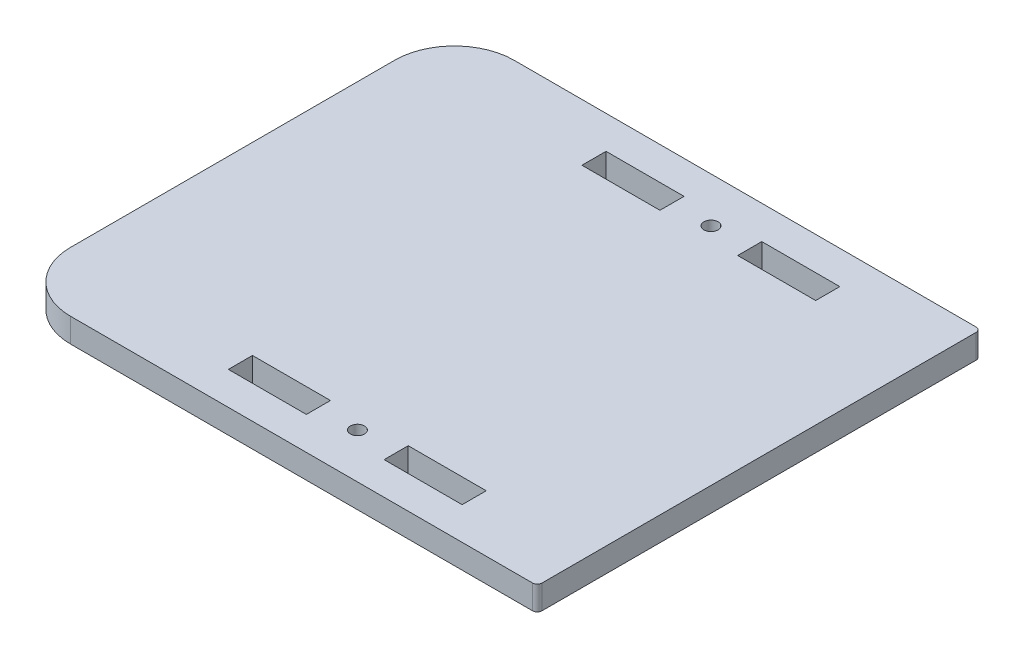
ISO-10303-21;
HEADER;
FILE_DESCRIPTION(('STEP AP214'),'2;1');
FILE_NAME('part.step','',(''),(''),'','','');
FILE_SCHEMA(('AUTOMOTIVE_DESIGN { 1 0 10303 214 1 1 1 1 }'));
ENDSEC;
DATA;
#1=APPLICATION_CONTEXT('core data for automotive mechanical design processes');
#2=APPLICATION_PROTOCOL_DEFINITION('international standard','automotive_design',2000,#1);
#3=PRODUCT_CONTEXT('',#1,'mechanical');
#4=PRODUCT('Part','Part','',(#3));
#5=PRODUCT_RELATED_PRODUCT_CATEGORY('part','',(#4));
#6=PRODUCT_DEFINITION_FORMATION('','',#4);
#7=PRODUCT_DEFINITION_CONTEXT('part definition',#1,'design');
#8=PRODUCT_DEFINITION('design','',#6,#7);
#9=PRODUCT_DEFINITION_SHAPE('','',#8);
#10=(LENGTH_UNIT() NAMED_UNIT(*) SI_UNIT(.MILLI.,.METRE.));
#11=(NAMED_UNIT(*) PLANE_ANGLE_UNIT() SI_UNIT($,.RADIAN.));
#12=(NAMED_UNIT(*) SI_UNIT($,.STERADIAN.) SOLID_ANGLE_UNIT());
#13=UNCERTAINTY_MEASURE_WITH_UNIT(LENGTH_MEASURE(1.E-05),#10,'distance_accuracy_value','');
#14=(GEOMETRIC_REPRESENTATION_CONTEXT(3) GLOBAL_UNCERTAINTY_ASSIGNED_CONTEXT((#13)) GLOBAL_UNIT_ASSIGNED_CONTEXT((#10,
#11,#12)) REPRESENTATION_CONTEXT('',''));
#15=CARTESIAN_POINT('',(0.,0.,0.));
#16=DIRECTION('',(0.,0.,1.));
#17=DIRECTION('',(1.,0.,0.));
#18=AXIS2_PLACEMENT_3D('',#15,#16,#17);
#19=CARTESIAN_POINT('',(-2375.81956581574,5.13,-2126.95174286523));
#20=DIRECTION('',(0.,0.,-1.));
#21=DIRECTION('',(-1.,0.,0.));
#22=AXIS2_PLACEMENT_3D('',#19,#20,#21);
#23=PLANE('',#22);
#24=DIRECTION('',(1.,0.,0.));
#25=VECTOR('',#24,1.);
#26=CARTESIAN_POINT('',(-2375.81956581574,0.,-2126.95174286523));
#27=LINE('',#26,#25);
#28=CARTESIAN_POINT('',(-171.044103066148,0.,-2126.95174286523));
#29=VERTEX_POINT('',#28);
#30=CARTESIAN_POINT('',(-154.444103066148,0.,-2126.95174286523));
#31=VERTEX_POINT('',#30);
#32=EDGE_CURVE('E290',#29,#31,#27,.T.);
#33=ORIENTED_EDGE('',*,*,#32,.T.);
#34=DIRECTION('',(0.,-1.,0.));
#35=VECTOR('',#34,1.);
#36=CARTESIAN_POINT('',(-154.444103066148,5.13,-2126.95174286523));
#37=LINE('',#36,#35);
#38=CARTESIAN_POINT('',(-154.444103066148,5.13,-2126.95174286523));
#39=VERTEX_POINT('',#38);
#40=EDGE_CURVE('E11',#39,#31,#37,.T.);
#41=ORIENTED_EDGE('',*,*,#40,.F.);
#42=DIRECTION('',(1.,0.,0.));
#43=VECTOR('',#42,1.);
#44=CARTESIAN_POINT('',(-2375.81956581574,5.13,-2126.95174286523));
#45=LINE('',#44,#43);
#46=CARTESIAN_POINT('',(-171.044103066148,5.13,-2126.95174286523));
#47=VERTEX_POINT('',#46);
#48=EDGE_CURVE('E208',#47,#39,#45,.T.);
#49=ORIENTED_EDGE('',*,*,#48,.F.);
#50=DIRECTION('',(0.,-1.,0.));
#51=VECTOR('',#50,1.);
#52=CARTESIAN_POINT('',(-171.044103066148,5.13,-2126.95174286523));
#53=LINE('',#52,#51);
#54=EDGE_CURVE('E52',#47,#29,#53,.T.);
#55=ORIENTED_EDGE('',*,*,#54,.T.);
#56=EDGE_LOOP('',(#33,#41,#49,#55));
#57=FACE_BOUND('',#56,.T.);
#58=ADVANCED_FACE('F33',(#57),#23,.F.);
#59=CARTESIAN_POINT('',(-154.444103066148,5.13,-1415.3278593277));
#60=DIRECTION('',(1.,0.,0.));
#61=DIRECTION('',(0.,0.,-1.));
#62=AXIS2_PLACEMENT_3D('',#59,#60,#61);
#63=PLANE('',#62);
#64=DIRECTION('',(0.,0.,1.));
#65=VECTOR('',#64,1.);
#66=CARTESIAN_POINT('',(-154.444103066148,0.,-1415.3278593277));
#67=LINE('',#66,#65);
#68=CARTESIAN_POINT('',(-154.444103066148,0.,-2121.82174286523));
#69=VERTEX_POINT('',#68);
#70=EDGE_CURVE('E214',#31,#69,#67,.T.);
#71=ORIENTED_EDGE('',*,*,#70,.T.);
#72=DIRECTION('',(0.,-1.,0.));
#73=VECTOR('',#72,1.);
#74=CARTESIAN_POINT('',(-154.444103066148,5.13,-2121.82174286523));
#75=LINE('',#74,#73);
#76=CARTESIAN_POINT('',(-154.444103066148,5.13,-2121.82174286523));
#77=VERTEX_POINT('',#76);
#78=EDGE_CURVE('E43',#77,#69,#75,.T.);
#79=ORIENTED_EDGE('',*,*,#78,.F.);
#80=DIRECTION('',(0.,0.,1.));
#81=VECTOR('',#80,1.);
#82=CARTESIAN_POINT('',(-154.444103066148,5.13,-1415.3278593277));
#83=LINE('',#82,#81);
#84=EDGE_CURVE('E202',#39,#77,#83,.T.);
#85=ORIENTED_EDGE('',*,*,#84,.F.);
#86=ORIENTED_EDGE('',*,*,#40,.T.);
#87=EDGE_LOOP('',(#71,#79,#85,#86));
#88=FACE_BOUND('',#87,.T.);
#89=ADVANCED_FACE('F213',(#88),#63,.F.);
#90=CARTESIAN_POINT('',(-2375.81956581574,5.13,-2121.82174286523));
#91=DIRECTION('',(0.,0.,-1.));
#92=DIRECTION('',(-1.,0.,0.));
#93=AXIS2_PLACEMENT_3D('',#90,#91,#92);
#94=PLANE('',#93);
#95=DIRECTION('',(1.,0.,0.));
#96=VECTOR('',#95,1.);
#97=CARTESIAN_POINT('',(-2375.81956581574,0.,-2121.82174286523));
#98=LINE('',#97,#96);
#99=CARTESIAN_POINT('',(-171.044103066148,0.,-2121.82174286523));
#100=VERTEX_POINT('',#99);
#101=EDGE_CURVE('E293',#100,#69,#98,.T.);
#102=ORIENTED_EDGE('',*,*,#101,.F.);
#103=DIRECTION('',(0.,-1.,0.));
#104=VECTOR('',#103,1.);
#105=CARTESIAN_POINT('',(-171.044103066148,5.13,-2121.82174286523));
#106=LINE('',#105,#104);
#107=CARTESIAN_POINT('',(-171.044103066148,5.13,-2121.82174286523));
#108=VERTEX_POINT('',#107);
#109=EDGE_CURVE('E126',#108,#100,#106,.T.);
#110=ORIENTED_EDGE('',*,*,#109,.F.);
#111=DIRECTION('',(1.,0.,0.));
#112=VECTOR('',#111,1.);
#113=CARTESIAN_POINT('',(-2375.81956581574,5.13,-2121.82174286523));
#114=LINE('',#113,#112);
#115=EDGE_CURVE('E207',#108,#77,#114,.T.);
#116=ORIENTED_EDGE('',*,*,#115,.T.);
#117=ORIENTED_EDGE('',*,*,#78,.T.);
#118=EDGE_LOOP('',(#102,#110,#116,#117));
#119=FACE_BOUND('',#118,.T.);
#120=ADVANCED_FACE('F218',(#119),#94,.T.);
#121=CARTESIAN_POINT('',(-2375.81956581574,5.13,-2202.18093369312));
#122=DIRECTION('',(0.,0.,-1.));
#123=DIRECTION('',(-1.,0.,0.));
#124=AXIS2_PLACEMENT_3D('',#121,#122,#123);
#125=PLANE('',#124);
#126=DIRECTION('',(1.,0.,0.));
#127=VECTOR('',#126,1.);
#128=CARTESIAN_POINT('',(-2375.81956581574,0.,-2202.18093369312));
#129=LINE('',#128,#127);
#130=CARTESIAN_POINT('',(-171.044103066148,0.,-2202.18093369312));
#131=VERTEX_POINT('',#130);
#132=CARTESIAN_POINT('',(-154.444103066148,0.,-2202.18093369312));
#133=VERTEX_POINT('',#132);
#134=EDGE_CURVE('E278',#131,#133,#129,.T.);
#135=ORIENTED_EDGE('',*,*,#134,.T.);
#136=DIRECTION('',(0.,-1.,0.));
#137=VECTOR('',#136,1.);
#138=CARTESIAN_POINT('',(-154.444103066148,5.13,-2202.18093369312));
#139=LINE('',#138,#137);
#140=CARTESIAN_POINT('',(-154.444103066148,5.13,-2202.18093369312));
#141=VERTEX_POINT('',#140);
#142=EDGE_CURVE('E300',#141,#133,#139,.T.);
#143=ORIENTED_EDGE('',*,*,#142,.F.);
#144=DIRECTION('',(1.,0.,0.));
#145=VECTOR('',#144,1.);
#146=CARTESIAN_POINT('',(-2375.81956581574,5.13,-2202.18093369312));
#147=LINE('',#146,#145);
#148=CARTESIAN_POINT('',(-171.044103066148,5.13,-2202.18093369312));
#149=VERTEX_POINT('',#148);
#150=EDGE_CURVE('E408',#149,#141,#147,.T.);
#151=ORIENTED_EDGE('',*,*,#150,.F.);
#152=DIRECTION('',(0.,-1.,0.));
#153=VECTOR('',#152,1.);
#154=CARTESIAN_POINT('',(-171.044103066148,5.13,-2202.18093369312));
#155=LINE('',#154,#153);
#156=EDGE_CURVE('E302',#149,#131,#155,.T.);
#157=ORIENTED_EDGE('',*,*,#156,.T.);
#158=EDGE_LOOP('',(#135,#143,#151,#157));
#159=FACE_BOUND('',#158,.T.);
#160=ADVANCED_FACE('F434',(#159),#125,.F.);
#161=CARTESIAN_POINT('',(-154.444103066148,5.13,-1415.3278593277));
#162=DIRECTION('',(1.,0.,0.));
#163=DIRECTION('',(0.,0.,-1.));
#164=AXIS2_PLACEMENT_3D('',#161,#162,#163);
#165=PLANE('',#164);
#166=DIRECTION('',(0.,0.,1.));
#167=VECTOR('',#166,1.);
#168=CARTESIAN_POINT('',(-154.444103066148,0.,-1415.3278593277));
#169=LINE('',#168,#167);
#170=CARTESIAN_POINT('',(-154.444103066148,0.,-2197.05093369312));
#171=VERTEX_POINT('',#170);
#172=EDGE_CURVE('E281',#133,#171,#169,.T.);
#173=ORIENTED_EDGE('',*,*,#172,.T.);
#174=DIRECTION('',(0.,-1.,0.));
#175=VECTOR('',#174,1.);
#176=CARTESIAN_POINT('',(-154.444103066148,5.13,-2197.05093369312));
#177=LINE('',#176,#175);
#178=CARTESIAN_POINT('',(-154.444103066148,5.13,-2197.05093369312));
#179=VERTEX_POINT('',#178);
#180=EDGE_CURVE('E307',#179,#171,#177,.T.);
#181=ORIENTED_EDGE('',*,*,#180,.F.);
#182=DIRECTION('',(0.,0.,1.));
#183=VECTOR('',#182,1.);
#184=CARTESIAN_POINT('',(-154.444103066148,5.13,-1415.3278593277));
#185=LINE('',#184,#183);
#186=EDGE_CURVE('E411',#141,#179,#185,.T.);
#187=ORIENTED_EDGE('',*,*,#186,.F.);
#188=ORIENTED_EDGE('',*,*,#142,.T.);
#189=EDGE_LOOP('',(#173,#181,#187,#188));
#190=FACE_BOUND('',#189,.T.);
#191=ADVANCED_FACE('F436',(#190),#165,.F.);
#192=CARTESIAN_POINT('',(-2375.81956581574,5.13,-2197.05093369312));
#193=DIRECTION('',(0.,0.,-1.));
#194=DIRECTION('',(-1.,0.,0.));
#195=AXIS2_PLACEMENT_3D('',#192,#193,#194);
#196=PLANE('',#195);
#197=DIRECTION('',(1.,0.,0.));
#198=VECTOR('',#197,1.);
#199=CARTESIAN_POINT('',(-2375.81956581574,0.,-2197.05093369312));
#200=LINE('',#199,#198);
#201=CARTESIAN_POINT('',(-171.044103066148,0.,-2197.05093369312));
#202=VERTEX_POINT('',#201);
#203=EDGE_CURVE('E284',#202,#171,#200,.T.);
#204=ORIENTED_EDGE('',*,*,#203,.F.);
#205=DIRECTION('',(0.,-1.,0.));
#206=VECTOR('',#205,1.);
#207=CARTESIAN_POINT('',(-171.044103066148,5.13,-2197.05093369312));
#208=LINE('',#207,#206);
#209=CARTESIAN_POINT('',(-171.044103066148,5.13,-2197.05093369312));
#210=VERTEX_POINT('',#209);
#211=EDGE_CURVE('E304',#210,#202,#208,.T.);
#212=ORIENTED_EDGE('',*,*,#211,.F.);
#213=DIRECTION('',(1.,0.,0.));
#214=VECTOR('',#213,1.);
#215=CARTESIAN_POINT('',(-2375.81956581574,5.13,-2197.05093369312));
#216=LINE('',#215,#214);
#217=EDGE_CURVE('E413',#210,#179,#216,.T.);
#218=ORIENTED_EDGE('',*,*,#217,.T.);
#219=ORIENTED_EDGE('',*,*,#180,.T.);
#220=EDGE_LOOP('',(#204,#212,#218,#219));
#221=FACE_BOUND('',#220,.T.);
#222=ADVANCED_FACE('F429',(#221),#196,.T.);
#223=CARTESIAN_POINT('',(-2375.81956581574,5.13,-2126.89149427628));
#224=DIRECTION('',(0.,0.,-1.));
#225=DIRECTION('',(-1.,0.,0.));
#226=AXIS2_PLACEMENT_3D('',#223,#224,#225);
#227=PLANE('',#226);
#228=DIRECTION('',(1.,0.,0.));
#229=VECTOR('',#228,1.);
#230=CARTESIAN_POINT('',(-2375.81956581574,0.,-2126.89149427628));
#231=LINE('',#230,#229);
#232=CARTESIAN_POINT('',(-137.844103066152,0.,-2126.89149427628));
#233=VERTEX_POINT('',#232);
#234=CARTESIAN_POINT('',(-121.244103066152,0.,-2126.89149427628));
#235=VERTEX_POINT('',#234);
#236=EDGE_CURVE('E266',#233,#235,#231,.T.);
#237=ORIENTED_EDGE('',*,*,#236,.T.);
#238=DIRECTION('',(0.,-1.,0.));
#239=VECTOR('',#238,1.);
#240=CARTESIAN_POINT('',(-121.244103066152,5.13,-2126.89149427628));
#241=LINE('',#240,#239);
#242=CARTESIAN_POINT('',(-121.244103066152,5.13,-2126.89149427628));
#243=VERTEX_POINT('',#242);
#244=EDGE_CURVE('E305',#243,#235,#241,.T.);
#245=ORIENTED_EDGE('',*,*,#244,.F.);
#246=DIRECTION('',(1.,0.,0.));
#247=VECTOR('',#246,1.);
#248=CARTESIAN_POINT('',(-2375.81956581574,5.13,-2126.89149427628));
#249=LINE('',#248,#247);
#250=CARTESIAN_POINT('',(-137.844103066152,5.13,-2126.89149427628));
#251=VERTEX_POINT('',#250);
#252=EDGE_CURVE('E397',#251,#243,#249,.T.);
#253=ORIENTED_EDGE('',*,*,#252,.F.);
#254=DIRECTION('',(0.,-1.,0.));
#255=VECTOR('',#254,1.);
#256=CARTESIAN_POINT('',(-137.844103066152,5.13,-2126.89149427628));
#257=LINE('',#256,#255);
#258=EDGE_CURVE('E311',#251,#233,#257,.T.);
#259=ORIENTED_EDGE('',*,*,#258,.T.);
#260=EDGE_LOOP('',(#237,#245,#253,#259));
#261=FACE_BOUND('',#260,.T.);
#262=ADVANCED_FACE('F443',(#261),#227,.F.);
#263=CARTESIAN_POINT('',(-121.244103066152,5.13,-1415.3278593277));
#264=DIRECTION('',(1.,0.,0.));
#265=DIRECTION('',(0.,0.,-1.));
#266=AXIS2_PLACEMENT_3D('',#263,#264,#265);
#267=PLANE('',#266);
#268=DIRECTION('',(0.,0.,1.));
#269=VECTOR('',#268,1.);
#270=CARTESIAN_POINT('',(-121.244103066152,0.,-1415.3278593277));
#271=LINE('',#270,#269);
#272=CARTESIAN_POINT('',(-121.244103066152,0.,-2121.76149427628));
#273=VERTEX_POINT('',#272);
#274=EDGE_CURVE('E269',#235,#273,#271,.T.);
#275=ORIENTED_EDGE('',*,*,#274,.T.);
#276=DIRECTION('',(0.,-1.,0.));
#277=VECTOR('',#276,1.);
#278=CARTESIAN_POINT('',(-121.244103066152,5.13,-2121.76149427628));
#279=LINE('',#278,#277);
#280=CARTESIAN_POINT('',(-121.244103066152,5.13,-2121.76149427628));
#281=VERTEX_POINT('',#280);
#282=EDGE_CURVE('E316',#281,#273,#279,.T.);
#283=ORIENTED_EDGE('',*,*,#282,.F.);
#284=DIRECTION('',(0.,0.,1.));
#285=VECTOR('',#284,1.);
#286=CARTESIAN_POINT('',(-121.244103066152,5.13,-1415.3278593277));
#287=LINE('',#286,#285);
#288=EDGE_CURVE('E400',#243,#281,#287,.T.);
#289=ORIENTED_EDGE('',*,*,#288,.F.);
#290=ORIENTED_EDGE('',*,*,#244,.T.);
#291=EDGE_LOOP('',(#275,#283,#289,#290));
#292=FACE_BOUND('',#291,.T.);
#293=ADVANCED_FACE('F542',(#292),#267,.F.);
#294=CARTESIAN_POINT('',(-2375.81956581574,5.13,-2121.76149427628));
#295=DIRECTION('',(0.,0.,-1.));
#296=DIRECTION('',(-1.,0.,0.));
#297=AXIS2_PLACEMENT_3D('',#294,#295,#296);
#298=PLANE('',#297);
#299=DIRECTION('',(1.,0.,0.));
#300=VECTOR('',#299,1.);
#301=CARTESIAN_POINT('',(-2375.81956581574,0.,-2121.76149427628));
#302=LINE('',#301,#300);
#303=CARTESIAN_POINT('',(-137.844103066152,0.,-2121.76149427628));
#304=VERTEX_POINT('',#303);
#305=EDGE_CURVE('E272',#304,#273,#302,.T.);
#306=ORIENTED_EDGE('',*,*,#305,.F.);
#307=DIRECTION('',(0.,-1.,0.));
#308=VECTOR('',#307,1.);
#309=CARTESIAN_POINT('',(-137.844103066152,5.13,-2121.76149427628));
#310=LINE('',#309,#308);
#311=CARTESIAN_POINT('',(-137.844103066152,5.13,-2121.76149427628));
#312=VERTEX_POINT('',#311);
#313=EDGE_CURVE('E313',#312,#304,#310,.T.);
#314=ORIENTED_EDGE('',*,*,#313,.F.);
#315=DIRECTION('',(1.,0.,0.));
#316=VECTOR('',#315,1.);
#317=CARTESIAN_POINT('',(-2375.81956581574,5.13,-2121.76149427628));
#318=LINE('',#317,#316);
#319=EDGE_CURVE('E402',#312,#281,#318,.T.);
#320=ORIENTED_EDGE('',*,*,#319,.T.);
#321=ORIENTED_EDGE('',*,*,#282,.T.);
#322=EDGE_LOOP('',(#306,#314,#320,#321));
#323=FACE_BOUND('',#322,.T.);
#324=ADVANCED_FACE('F507',(#323),#298,.T.);
#325=CARTESIAN_POINT('',(-2375.81956581574,5.13,-2202.12068510417));
#326=DIRECTION('',(0.,0.,-1.));
#327=DIRECTION('',(-1.,0.,0.));
#328=AXIS2_PLACEMENT_3D('',#325,#326,#327);
#329=PLANE('',#328);
#330=DIRECTION('',(1.,0.,0.));
#331=VECTOR('',#330,1.);
#332=CARTESIAN_POINT('',(-2375.81956581574,0.,-2202.12068510417));
#333=LINE('',#332,#331);
#334=CARTESIAN_POINT('',(-137.844103066152,0.,-2202.12068510417));
#335=VERTEX_POINT('',#334);
#336=CARTESIAN_POINT('',(-121.244103066152,0.,-2202.12068510417));
#337=VERTEX_POINT('',#336);
#338=EDGE_CURVE('E254',#335,#337,#333,.T.);
#339=ORIENTED_EDGE('',*,*,#338,.T.);
#340=DIRECTION('',(0.,-1.,0.));
#341=VECTOR('',#340,1.);
#342=CARTESIAN_POINT('',(-121.244103066152,5.13,-2202.12068510417));
#343=LINE('',#342,#341);
#344=CARTESIAN_POINT('',(-121.244103066152,5.13,-2202.12068510417));
#345=VERTEX_POINT('',#344);
#346=EDGE_CURVE('E314',#345,#337,#343,.T.);
#347=ORIENTED_EDGE('',*,*,#346,.F.);
#348=DIRECTION('',(1.,0.,0.));
#349=VECTOR('',#348,1.);
#350=CARTESIAN_POINT('',(-2375.81956581574,5.13,-2202.12068510417));
#351=LINE('',#350,#349);
#352=CARTESIAN_POINT('',(-137.844103066152,5.13,-2202.12068510417));
#353=VERTEX_POINT('',#352);
#354=EDGE_CURVE('E386',#353,#345,#351,.T.);
#355=ORIENTED_EDGE('',*,*,#354,.F.);
#356=DIRECTION('',(0.,-1.,0.));
#357=VECTOR('',#356,1.);
#358=CARTESIAN_POINT('',(-137.844103066152,5.13,-2202.12068510417));
#359=LINE('',#358,#357);
#360=EDGE_CURVE('E320',#353,#335,#359,.T.);
#361=ORIENTED_EDGE('',*,*,#360,.T.);
#362=EDGE_LOOP('',(#339,#347,#355,#361));
#363=FACE_BOUND('',#362,.T.);
#364=ADVANCED_FACE('F498',(#363),#329,.F.);
#365=CARTESIAN_POINT('',(-121.244103066152,5.13,-1415.3278593277));
#366=DIRECTION('',(1.,0.,0.));
#367=DIRECTION('',(0.,0.,-1.));
#368=AXIS2_PLACEMENT_3D('',#365,#366,#367);
#369=PLANE('',#368);
#370=DIRECTION('',(0.,0.,1.));
#371=VECTOR('',#370,1.);
#372=CARTESIAN_POINT('',(-121.244103066152,0.,-1415.3278593277));
#373=LINE('',#372,#371);
#374=CARTESIAN_POINT('',(-121.244103066152,0.,-2196.99068510417));
#375=VERTEX_POINT('',#374);
#376=EDGE_CURVE('E257',#337,#375,#373,.T.);
#377=ORIENTED_EDGE('',*,*,#376,.T.);
#378=DIRECTION('',(0.,-1.,0.));
#379=VECTOR('',#378,1.);
#380=CARTESIAN_POINT('',(-121.244103066152,5.13,-2196.99068510417));
#381=LINE('',#380,#379);
#382=CARTESIAN_POINT('',(-121.244103066152,5.13,-2196.99068510417));
#383=VERTEX_POINT('',#382);
#384=EDGE_CURVE('E324',#383,#375,#381,.T.);
#385=ORIENTED_EDGE('',*,*,#384,.F.);
#386=DIRECTION('',(0.,0.,1.));
#387=VECTOR('',#386,1.);
#388=CARTESIAN_POINT('',(-121.244103066152,5.13,-1415.3278593277));
#389=LINE('',#388,#387);
#390=EDGE_CURVE('E389',#345,#383,#389,.T.);
#391=ORIENTED_EDGE('',*,*,#390,.F.);
#392=ORIENTED_EDGE('',*,*,#346,.T.);
#393=EDGE_LOOP('',(#377,#385,#391,#392));
#394=FACE_BOUND('',#393,.T.);
#395=ADVANCED_FACE('F492',(#394),#369,.F.);
#396=CARTESIAN_POINT('',(-2375.81956581574,5.13,-2196.99068510417));
#397=DIRECTION('',(0.,0.,-1.));
#398=DIRECTION('',(-1.,0.,0.));
#399=AXIS2_PLACEMENT_3D('',#396,#397,#398);
#400=PLANE('',#399);
#401=DIRECTION('',(1.,0.,0.));
#402=VECTOR('',#401,1.);
#403=CARTESIAN_POINT('',(-2375.81956581574,0.,-2196.99068510417));
#404=LINE('',#403,#402);
#405=CARTESIAN_POINT('',(-137.844103066152,0.,-2196.99068510417));
#406=VERTEX_POINT('',#405);
#407=EDGE_CURVE('E260',#406,#375,#404,.T.);
#408=ORIENTED_EDGE('',*,*,#407,.F.);
#409=DIRECTION('',(0.,-1.,0.));
#410=VECTOR('',#409,1.);
#411=CARTESIAN_POINT('',(-137.844103066152,5.13,-2196.99068510417));
#412=LINE('',#411,#410);
#413=CARTESIAN_POINT('',(-137.844103066152,5.13,-2196.99068510417));
#414=VERTEX_POINT('',#413);
#415=EDGE_CURVE('E322',#414,#406,#412,.T.);
#416=ORIENTED_EDGE('',*,*,#415,.F.);
#417=DIRECTION('',(1.,0.,0.));
#418=VECTOR('',#417,1.);
#419=CARTESIAN_POINT('',(-2375.81956581574,5.13,-2196.99068510417));
#420=LINE('',#419,#418);
#421=EDGE_CURVE('E391',#414,#383,#420,.T.);
#422=ORIENTED_EDGE('',*,*,#421,.T.);
#423=ORIENTED_EDGE('',*,*,#384,.T.);
#424=EDGE_LOOP('',(#408,#416,#422,#423));
#425=FACE_BOUND('',#424,.T.);
#426=ADVANCED_FACE('F488',(#425),#400,.T.);
#427=CARTESIAN_POINT('',(-99.3141030661499,5.13,-2115.82174286523));
#428=DIRECTION('',(0.,-1.,0.));
#429=DIRECTION('',(0.,0.,-1.));
#430=AXIS2_PLACEMENT_3D('',#427,#428,#429);
#431=CYLINDRICAL_SURFACE('',#430,0.999999999999723);
#432=CARTESIAN_POINT('',(-99.3141030661499,0.,-2115.82174286523));
#433=DIRECTION('',(0.,1.,0.));
#434=DIRECTION('',(0.,0.,1.));
#435=AXIS2_PLACEMENT_3D('',#432,#433,#434);
#436=CIRCLE('',#435,0.999999999999723);
#437=CARTESIAN_POINT('',(-98.3141030661501,0.,-2115.82174286523));
#438=VERTEX_POINT('',#437);
#439=CARTESIAN_POINT('',(-99.31410306615,0.,-2114.82174286523));
#440=VERTEX_POINT('',#439);
#441=EDGE_CURVE('E225',#438,#440,#436,.F.);
#442=ORIENTED_EDGE('',*,*,#441,.F.);
#443=DIRECTION('',(0.,-1.,0.));
#444=VECTOR('',#443,1.);
#445=CARTESIAN_POINT('',(-98.3141030661501,5.13,-2115.82174286523));
#446=LINE('',#445,#444);
#447=CARTESIAN_POINT('',(-98.3141030661501,5.13,-2115.82174286523));
#448=VERTEX_POINT('',#447);
#449=EDGE_CURVE('E37',#448,#438,#446,.T.);
#450=ORIENTED_EDGE('',*,*,#449,.F.);
#451=CARTESIAN_POINT('',(-99.3141030661499,5.13,-2115.82174286523));
#452=DIRECTION('',(0.,1.,0.));
#453=DIRECTION('',(0.,0.,1.));
#454=AXIS2_PLACEMENT_3D('',#451,#452,#453);
#455=CIRCLE('',#454,0.999999999999723);
#456=CARTESIAN_POINT('',(-99.31410306615,5.13,-2114.82174286523));
#457=VERTEX_POINT('',#456);
#458=EDGE_CURVE('E298',#448,#457,#455,.F.);
#459=ORIENTED_EDGE('',*,*,#458,.T.);
#460=DIRECTION('',(0.,-1.,0.));
#461=VECTOR('',#460,1.);
#462=CARTESIAN_POINT('',(-99.31410306615,5.13,-2114.82174286523));
#463=LINE('',#462,#461);
#464=EDGE_CURVE('E221',#457,#440,#463,.T.);
#465=ORIENTED_EDGE('',*,*,#464,.T.);
#466=EDGE_LOOP('',(#442,#450,#459,#465));
#467=FACE_BOUND('',#466,.T.);
#468=ADVANCED_FACE('F35',(#467),#431,.T.);
#469=CARTESIAN_POINT('',(-98.3141030661501,5.13,-1415.3278593277));
#470=DIRECTION('',(1.,0.,0.));
#471=DIRECTION('',(0.,0.,-1.));
#472=AXIS2_PLACEMENT_3D('',#469,#470,#471);
#473=PLANE('',#472);
#474=DIRECTION('',(0.,0.,1.));
#475=VECTOR('',#474,1.);
#476=CARTESIAN_POINT('',(-98.3141030661501,0.,-1415.3278593277));
#477=LINE('',#476,#475);
#478=CARTESIAN_POINT('',(-98.3141030661501,0.,-2208.18174286523));
#479=VERTEX_POINT('',#478);
#480=EDGE_CURVE('E228',#479,#438,#477,.T.);
#481=ORIENTED_EDGE('',*,*,#480,.F.);
#482=DIRECTION('',(0.,-1.,0.));
#483=VECTOR('',#482,1.);
#484=CARTESIAN_POINT('',(-98.3141030661501,5.13,-2208.18174286523));
#485=LINE('',#484,#483);
#486=CARTESIAN_POINT('',(-98.3141030661501,5.13,-2208.18174286523));
#487=VERTEX_POINT('',#486);
#488=EDGE_CURVE('E339',#487,#479,#485,.T.);
#489=ORIENTED_EDGE('',*,*,#488,.F.);
#490=DIRECTION('',(0.,0.,1.));
#491=VECTOR('',#490,1.);
#492=CARTESIAN_POINT('',(-98.3141030661501,5.13,-1415.3278593277));
#493=LINE('',#492,#491);
#494=EDGE_CURVE('E348',#487,#448,#493,.T.);
#495=ORIENTED_EDGE('',*,*,#494,.T.);
#496=ORIENTED_EDGE('',*,*,#449,.T.);
#497=EDGE_LOOP('',(#481,#489,#495,#496));
#498=FACE_BOUND('',#497,.T.);
#499=ADVANCED_FACE('F346',(#498),#473,.T.);
#500=CARTESIAN_POINT('',(-99.3141030661499,5.13,-2208.18174286523));
#501=DIRECTION('',(0.,-1.,0.));
#502=DIRECTION('',(0.,0.,-1.));
#503=AXIS2_PLACEMENT_3D('',#500,#501,#502);
#504=CYLINDRICAL_SURFACE('',#503,1.00000000000017);
#505=CARTESIAN_POINT('',(-99.3141030661499,0.,-2208.18174286523));
#506=DIRECTION('',(0.,1.,0.));
#507=DIRECTION('',(0.,0.,1.));
#508=AXIS2_PLACEMENT_3D('',#505,#506,#507);
#509=CIRCLE('',#508,1.00000000000017);
#510=CARTESIAN_POINT('',(-99.31410306615,0.,-2209.18174286523));
#511=VERTEX_POINT('',#510);
#512=EDGE_CURVE('E231',#479,#511,#509,.T.);
#513=ORIENTED_EDGE('',*,*,#512,.T.);
#514=DIRECTION('',(0.,-1.,0.));
#515=VECTOR('',#514,1.);
#516=CARTESIAN_POINT('',(-99.31410306615,5.13,-2209.18174286523));
#517=LINE('',#516,#515);
#518=CARTESIAN_POINT('',(-99.31410306615,5.13,-2209.18174286523));
#519=VERTEX_POINT('',#518);
#520=EDGE_CURVE('E337',#519,#511,#517,.T.);
#521=ORIENTED_EDGE('',*,*,#520,.F.);
#522=CARTESIAN_POINT('',(-99.3141030661499,5.13,-2208.18174286523));
#523=DIRECTION('',(0.,1.,0.));
#524=DIRECTION('',(0.,0.,1.));
#525=AXIS2_PLACEMENT_3D('',#522,#523,#524);
#526=CIRCLE('',#525,1.00000000000017);
#527=EDGE_CURVE('E366',#487,#519,#526,.T.);
#528=ORIENTED_EDGE('',*,*,#527,.F.);
#529=ORIENTED_EDGE('',*,*,#488,.T.);
#530=EDGE_LOOP('',(#513,#521,#528,#529));
#531=FACE_BOUND('',#530,.T.);
#532=ADVANCED_FACE('F356',(#531),#504,.T.);
#533=CARTESIAN_POINT('',(-2375.81956581575,5.13,-2209.18174286521));
#534=DIRECTION('',(0.,0.,1.));
#535=DIRECTION('',(1.,0.,0.));
#536=AXIS2_PLACEMENT_3D('',#533,#534,#535);
#537=PLANE('',#536);
#538=DIRECTION('',(-1.,0.,0.));
#539=VECTOR('',#538,1.);
#540=CARTESIAN_POINT('',(-2375.81956581575,0.,-2209.18174286521));
#541=LINE('',#540,#539);
#542=CARTESIAN_POINT('',(-197.61410306615,0.,-2209.18174286523));
#543=VERTEX_POINT('',#542);
#544=EDGE_CURVE('E233',#511,#543,#541,.T.);
#545=ORIENTED_EDGE('',*,*,#544,.T.);
#546=DIRECTION('',(0.,-1.,0.));
#547=VECTOR('',#546,1.);
#548=CARTESIAN_POINT('',(-197.61410306615,5.13,-2209.18174286523));
#549=LINE('',#548,#547);
#550=CARTESIAN_POINT('',(-197.61410306615,5.13,-2209.18174286523));
#551=VERTEX_POINT('',#550);
#552=EDGE_CURVE('E335',#551,#543,#549,.T.);
#553=ORIENTED_EDGE('',*,*,#552,.F.);
#554=DIRECTION('',(-1.,0.,0.));
#555=VECTOR('',#554,1.);
#556=CARTESIAN_POINT('',(-2375.81956581575,5.13,-2209.18174286521));
#557=LINE('',#556,#555);
#558=EDGE_CURVE('E361',#519,#551,#557,.T.);
#559=ORIENTED_EDGE('',*,*,#558,.F.);
#560=ORIENTED_EDGE('',*,*,#520,.T.);
#561=EDGE_LOOP('',(#545,#553,#559,#560));
#562=FACE_BOUND('',#561,.T.);
#563=ADVANCED_FACE('F359',(#562),#537,.F.);
#564=CARTESIAN_POINT('',(-197.61410306615,5.13,-2196.48174286523));
#565=DIRECTION('',(0.,-1.,0.));
#566=DIRECTION('',(0.,0.,-1.));
#567=AXIS2_PLACEMENT_3D('',#564,#565,#566);
#568=CYLINDRICAL_SURFACE('',#567,12.7000000000003);
#569=CARTESIAN_POINT('',(-197.61410306615,0.,-2196.48174286523));
#570=DIRECTION('',(0.,1.,0.));
#571=DIRECTION('',(0.,0.,1.));
#572=AXIS2_PLACEMENT_3D('',#569,#570,#571);
#573=CIRCLE('',#572,12.7000000000003);
#574=CARTESIAN_POINT('',(-210.31410306615,0.,-2196.48174286523));
#575=VERTEX_POINT('',#574);
#576=EDGE_CURVE('E236',#575,#543,#573,.F.);
#577=ORIENTED_EDGE('',*,*,#576,.F.);
#578=DIRECTION('',(0.,-1.,0.));
#579=VECTOR('',#578,1.);
#580=CARTESIAN_POINT('',(-210.31410306615,5.13,-2196.48174286523));
#581=LINE('',#580,#579);
#582=CARTESIAN_POINT('',(-210.31410306615,5.13,-2196.48174286523));
#583=VERTEX_POINT('',#582);
#584=EDGE_CURVE('E333',#583,#575,#581,.T.);
#585=ORIENTED_EDGE('',*,*,#584,.F.);
#586=CARTESIAN_POINT('',(-197.61410306615,5.13,-2196.48174286523));
#587=DIRECTION('',(0.,1.,0.));
#588=DIRECTION('',(0.,0.,1.));
#589=AXIS2_PLACEMENT_3D('',#586,#587,#588);
#590=CIRCLE('',#589,12.7000000000003);
#591=EDGE_CURVE('E365',#583,#551,#590,.F.);
#592=ORIENTED_EDGE('',*,*,#591,.T.);
#593=ORIENTED_EDGE('',*,*,#552,.T.);
#594=EDGE_LOOP('',(#577,#585,#592,#593));
#595=FACE_BOUND('',#594,.T.);
#596=ADVANCED_FACE('F470',(#595),#568,.T.);
#597=CARTESIAN_POINT('',(-210.31410306615,5.13,-1415.3278593277));
#598=DIRECTION('',(-1.,0.,0.));
#599=DIRECTION('',(0.,0.,1.));
#600=AXIS2_PLACEMENT_3D('',#597,#598,#599);
#601=PLANE('',#600);
#602=DIRECTION('',(0.,0.,-1.));
#603=VECTOR('',#602,1.);
#604=CARTESIAN_POINT('',(-210.31410306615,0.,-1415.3278593277));
#605=LINE('',#604,#603);
#606=CARTESIAN_POINT('',(-210.31410306615,0.,-2127.52174286523));
#607=VERTEX_POINT('',#606);
#608=EDGE_CURVE('E239',#607,#575,#605,.T.);
#609=ORIENTED_EDGE('',*,*,#608,.F.);
#610=DIRECTION('',(0.,-1.,0.));
#611=VECTOR('',#610,1.);
#612=CARTESIAN_POINT('',(-210.31410306615,5.13,-2127.52174286523));
#613=LINE('',#612,#611);
#614=CARTESIAN_POINT('',(-210.31410306615,5.13,-2127.52174286523));
#615=VERTEX_POINT('',#614);
#616=EDGE_CURVE('E331',#615,#607,#613,.T.);
#617=ORIENTED_EDGE('',*,*,#616,.F.);
#618=DIRECTION('',(0.,0.,-1.));
#619=VECTOR('',#618,1.);
#620=CARTESIAN_POINT('',(-210.31410306615,5.13,-1415.3278593277));
#621=LINE('',#620,#619);
#622=EDGE_CURVE('E368',#615,#583,#621,.T.);
#623=ORIENTED_EDGE('',*,*,#622,.T.);
#624=ORIENTED_EDGE('',*,*,#584,.T.);
#625=EDGE_LOOP('',(#609,#617,#623,#624));
#626=FACE_BOUND('',#625,.T.);
#627=ADVANCED_FACE('F464',(#626),#601,.T.);
#628=CARTESIAN_POINT('',(-197.61410306615,5.13,-2127.52174286523));
#629=DIRECTION('',(0.,-1.,0.));
#630=DIRECTION('',(0.,0.,-1.));
#631=AXIS2_PLACEMENT_3D('',#628,#629,#630);
#632=CYLINDRICAL_SURFACE('',#631,12.6999999999999);
#633=CARTESIAN_POINT('',(-197.61410306615,0.,-2127.52174286523));
#634=DIRECTION('',(0.,1.,0.));
#635=DIRECTION('',(0.,0.,1.));
#636=AXIS2_PLACEMENT_3D('',#633,#634,#635);
#637=CIRCLE('',#636,12.6999999999999);
#638=CARTESIAN_POINT('',(-197.61410306615,0.,-2114.82174286523));
#639=VERTEX_POINT('',#638);
#640=EDGE_CURVE('E242',#639,#607,#637,.F.);
#641=ORIENTED_EDGE('',*,*,#640,.F.);
#642=DIRECTION('',(0.,-1.,0.));
#643=VECTOR('',#642,1.);
#644=CARTESIAN_POINT('',(-197.61410306615,5.13,-2114.82174286523));
#645=LINE('',#644,#643);
#646=CARTESIAN_POINT('',(-197.61410306615,5.13,-2114.82174286523));
#647=VERTEX_POINT('',#646);
#648=EDGE_CURVE('E329',#647,#639,#645,.T.);
#649=ORIENTED_EDGE('',*,*,#648,.F.);
#650=CARTESIAN_POINT('',(-197.61410306615,5.13,-2127.52174286523));
#651=DIRECTION('',(0.,1.,0.));
#652=DIRECTION('',(0.,0.,1.));
#653=AXIS2_PLACEMENT_3D('',#650,#651,#652);
#654=CIRCLE('',#653,12.6999999999999);
#655=EDGE_CURVE('E375',#647,#615,#654,.F.);
#656=ORIENTED_EDGE('',*,*,#655,.T.);
#657=ORIENTED_EDGE('',*,*,#616,.T.);
#658=EDGE_LOOP('',(#641,#649,#656,#657));
#659=FACE_BOUND('',#658,.T.);
#660=ADVANCED_FACE('F456',(#659),#632,.T.);
#661=CARTESIAN_POINT('',(-171.044103066148,5.13,-1415.3278593277));
#662=DIRECTION('',(1.,0.,0.));
#663=DIRECTION('',(0.,0.,-1.));
#664=AXIS2_PLACEMENT_3D('',#661,#662,#663);
#665=PLANE('',#664);
#666=DIRECTION('',(0.,0.,1.));
#667=VECTOR('',#666,1.);
#668=CARTESIAN_POINT('',(-171.044103066148,0.,-1415.3278593277));
#669=LINE('',#668,#667);
#670=EDGE_CURVE('E287',#131,#202,#669,.T.);
#671=ORIENTED_EDGE('',*,*,#670,.F.);
#672=ORIENTED_EDGE('',*,*,#156,.F.);
#673=DIRECTION('',(0.,0.,1.));
#674=VECTOR('',#673,1.);
#675=CARTESIAN_POINT('',(-171.044103066148,5.13,-1415.3278593277));
#676=LINE('',#675,#674);
#677=EDGE_CURVE('E416',#149,#210,#676,.T.);
#678=ORIENTED_EDGE('',*,*,#677,.T.);
#679=ORIENTED_EDGE('',*,*,#211,.T.);
#680=EDGE_LOOP('',(#671,#672,#678,#679));
#681=FACE_BOUND('',#680,.T.);
#682=ADVANCED_FACE('F421',(#681),#665,.T.);
#683=CARTESIAN_POINT('',(-137.844103066152,5.13,-1415.3278593277));
#684=DIRECTION('',(1.,0.,0.));
#685=DIRECTION('',(0.,0.,-1.));
#686=AXIS2_PLACEMENT_3D('',#683,#684,#685);
#687=PLANE('',#686);
#688=DIRECTION('',(0.,0.,1.));
#689=VECTOR('',#688,1.);
#690=CARTESIAN_POINT('',(-137.844103066152,0.,-1415.3278593277));
#691=LINE('',#690,#689);
#692=EDGE_CURVE('E275',#233,#304,#691,.T.);
#693=ORIENTED_EDGE('',*,*,#692,.F.);
#694=ORIENTED_EDGE('',*,*,#258,.F.);
#695=DIRECTION('',(0.,0.,1.));
#696=VECTOR('',#695,1.);
#697=CARTESIAN_POINT('',(-137.844103066152,5.13,-1415.3278593277));
#698=LINE('',#697,#696);
#699=EDGE_CURVE('E405',#251,#312,#698,.T.);
#700=ORIENTED_EDGE('',*,*,#699,.T.);
#701=ORIENTED_EDGE('',*,*,#313,.T.);
#702=EDGE_LOOP('',(#693,#694,#700,#701));
#703=FACE_BOUND('',#702,.T.);
#704=ADVANCED_FACE('F455',(#703),#687,.T.);
#705=CARTESIAN_POINT('',(-137.844103066152,5.13,-1415.3278593277));
#706=DIRECTION('',(1.,0.,0.));
#707=DIRECTION('',(0.,0.,-1.));
#708=AXIS2_PLACEMENT_3D('',#705,#706,#707);
#709=PLANE('',#708);
#710=DIRECTION('',(0.,0.,1.));
#711=VECTOR('',#710,1.);
#712=CARTESIAN_POINT('',(-137.844103066152,0.,-1415.3278593277));
#713=LINE('',#712,#711);
#714=EDGE_CURVE('E263',#335,#406,#713,.T.);
#715=ORIENTED_EDGE('',*,*,#714,.F.);
#716=ORIENTED_EDGE('',*,*,#360,.F.);
#717=DIRECTION('',(0.,0.,1.));
#718=VECTOR('',#717,1.);
#719=CARTESIAN_POINT('',(-137.844103066152,5.13,-1415.3278593277));
#720=LINE('',#719,#718);
#721=EDGE_CURVE('E394',#353,#414,#720,.T.);
#722=ORIENTED_EDGE('',*,*,#721,.T.);
#723=ORIENTED_EDGE('',*,*,#415,.T.);
#724=EDGE_LOOP('',(#715,#716,#722,#723));
#725=FACE_BOUND('',#724,.T.);
#726=ADVANCED_FACE('F461',(#725),#709,.T.);
#727=CARTESIAN_POINT('',(-146.144103066152,5.13,-2199.61674286523));
#728=DIRECTION('',(0.,-1.,0.));
#729=DIRECTION('',(0.,0.,-1.));
#730=AXIS2_PLACEMENT_3D('',#727,#728,#729);
#731=CYLINDRICAL_SURFACE('',#730,1.49999999999962);
#732=CARTESIAN_POINT('',(-146.144103066152,5.13,-2199.61674286523));
#733=DIRECTION('',(0.,1.,0.));
#734=DIRECTION('',(0.,0.,1.));
#735=AXIS2_PLACEMENT_3D('',#732,#733,#734);
#736=CIRCLE('',#735,1.49999999999962);
#737=CARTESIAN_POINT('',(-146.144103066152,5.13,-2198.11674286523));
#738=VERTEX_POINT('',#737);
#739=EDGE_CURVE('E383',#738,#738,#736,.T.);
#740=ORIENTED_EDGE('',*,*,#739,.T.);
#741=EDGE_LOOP('',(#740));
#742=FACE_BOUND('',#741,.T.);
#743=CARTESIAN_POINT('',(-146.144103066152,0.,-2199.61674286523));
#744=DIRECTION('',(0.,1.,0.));
#745=DIRECTION('',(0.,0.,1.));
#746=AXIS2_PLACEMENT_3D('',#743,#744,#745);
#747=CIRCLE('',#746,1.49999999999962);
#748=CARTESIAN_POINT('',(-146.144103066152,0.,-2198.11674286523));
#749=VERTEX_POINT('',#748);
#750=EDGE_CURVE('E251',#749,#749,#747,.T.);
#751=ORIENTED_EDGE('',*,*,#750,.F.);
#752=EDGE_LOOP('',(#751));
#753=FACE_BOUND('',#752,.T.);
#754=ADVANCED_FACE('F509',(#742,#753),#731,.F.);
#755=CARTESIAN_POINT('',(-146.144103066148,5.13,-2124.38674286523));
#756=DIRECTION('',(0.,-1.,0.));
#757=DIRECTION('',(0.,0.,-1.));
#758=AXIS2_PLACEMENT_3D('',#755,#756,#757);
#759=CYLINDRICAL_SURFACE('',#758,1.49999999999962);
#760=CARTESIAN_POINT('',(-146.144103066148,5.13,-2124.38674286523));
#761=DIRECTION('',(0.,1.,0.));
#762=DIRECTION('',(0.,0.,1.));
#763=AXIS2_PLACEMENT_3D('',#760,#761,#762);
#764=CIRCLE('',#763,1.49999999999962);
#765=CARTESIAN_POINT('',(-146.144103066148,5.13,-2122.88674286523));
#766=VERTEX_POINT('',#765);
#767=EDGE_CURVE('E380',#766,#766,#764,.T.);
#768=ORIENTED_EDGE('',*,*,#767,.T.);
#769=EDGE_LOOP('',(#768));
#770=FACE_BOUND('',#769,.T.);
#771=CARTESIAN_POINT('',(-146.144103066148,0.,-2124.38674286523));
#772=DIRECTION('',(0.,1.,0.));
#773=DIRECTION('',(0.,0.,1.));
#774=AXIS2_PLACEMENT_3D('',#771,#772,#773);
#775=CIRCLE('',#774,1.49999999999962);
#776=CARTESIAN_POINT('',(-146.144103066148,0.,-2122.88674286523));
#777=VERTEX_POINT('',#776);
#778=EDGE_CURVE('E248',#777,#777,#775,.T.);
#779=ORIENTED_EDGE('',*,*,#778,.F.);
#780=EDGE_LOOP('',(#779));
#781=FACE_BOUND('',#780,.T.);
#782=ADVANCED_FACE('F511',(#770,#781),#759,.F.);
#783=CARTESIAN_POINT('',(-2375.81956581574,5.13,-2114.82174286523));
#784=DIRECTION('',(0.,0.,-1.));
#785=DIRECTION('',(-1.,0.,0.));
#786=AXIS2_PLACEMENT_3D('',#783,#784,#785);
#787=PLANE('',#786);
#788=DIRECTION('',(1.,0.,0.));
#789=VECTOR('',#788,1.);
#790=CARTESIAN_POINT('',(-2375.81956581574,0.,-2114.82174286523));
#791=LINE('',#790,#789);
#792=EDGE_CURVE('E245',#639,#440,#791,.T.);
#793=ORIENTED_EDGE('',*,*,#792,.T.);
#794=ORIENTED_EDGE('',*,*,#464,.F.);
#795=DIRECTION('',(1.,0.,0.));
#796=VECTOR('',#795,1.);
#797=CARTESIAN_POINT('',(-2375.81956581574,5.13,-2114.82174286523));
#798=LINE('',#797,#796);
#799=EDGE_CURVE('E378',#647,#457,#798,.T.);
#800=ORIENTED_EDGE('',*,*,#799,.F.);
#801=ORIENTED_EDGE('',*,*,#648,.T.);
#802=EDGE_LOOP('',(#793,#794,#800,#801));
#803=FACE_BOUND('',#802,.T.);
#804=ADVANCED_FACE('F475',(#803),#787,.F.);
#805=CARTESIAN_POINT('',(-171.044103066148,5.13,-1415.3278593277));
#806=DIRECTION('',(1.,0.,0.));
#807=DIRECTION('',(0.,0.,-1.));
#808=AXIS2_PLACEMENT_3D('',#805,#806,#807);
#809=PLANE('',#808);
#810=DIRECTION('',(0.,0.,1.));
#811=VECTOR('',#810,1.);
#812=CARTESIAN_POINT('',(-171.044103066148,0.,-1415.3278593277));
#813=LINE('',#812,#811);
#814=EDGE_CURVE('E295',#29,#100,#813,.T.);
#815=ORIENTED_EDGE('',*,*,#814,.F.);
#816=ORIENTED_EDGE('',*,*,#54,.F.);
#817=DIRECTION('',(0.,0.,1.));
#818=VECTOR('',#817,1.);
#819=CARTESIAN_POINT('',(-171.044103066148,5.13,-1415.3278593277));
#820=LINE('',#819,#818);
#821=EDGE_CURVE('E219',#47,#108,#820,.T.);
#822=ORIENTED_EDGE('',*,*,#821,.T.);
#823=ORIENTED_EDGE('',*,*,#109,.T.);
#824=EDGE_LOOP('',(#815,#816,#822,#823));
#825=FACE_BOUND('',#824,.T.);
#826=ADVANCED_FACE('F518',(#825),#809,.T.);
#827=CARTESIAN_POINT('',(-2375.81956581574,5.13,-1415.3278593277));
#828=DIRECTION('',(0.,1.,0.));
#829=DIRECTION('',(0.,0.,1.));
#830=AXIS2_PLACEMENT_3D('',#827,#828,#829);
#831=PLANE('',#830);
#832=ORIENTED_EDGE('',*,*,#458,.F.);
#833=ORIENTED_EDGE('',*,*,#494,.F.);
#834=ORIENTED_EDGE('',*,*,#527,.T.);
#835=ORIENTED_EDGE('',*,*,#558,.T.);
#836=ORIENTED_EDGE('',*,*,#591,.F.);
#837=ORIENTED_EDGE('',*,*,#622,.F.);
#838=ORIENTED_EDGE('',*,*,#655,.F.);
#839=ORIENTED_EDGE('',*,*,#799,.T.);
#840=EDGE_LOOP('',(#832,#833,#834,#835,#836,#837,#838,#839));
#841=FACE_BOUND('',#840,.T.);
#842=ORIENTED_EDGE('',*,*,#767,.F.);
#843=EDGE_LOOP('',(#842));
#844=FACE_BOUND('',#843,.T.);
#845=ORIENTED_EDGE('',*,*,#739,.F.);
#846=EDGE_LOOP('',(#845));
#847=FACE_BOUND('',#846,.T.);
#848=ORIENTED_EDGE('',*,*,#354,.T.);
#849=ORIENTED_EDGE('',*,*,#390,.T.);
#850=ORIENTED_EDGE('',*,*,#421,.F.);
#851=ORIENTED_EDGE('',*,*,#721,.F.);
#852=EDGE_LOOP('',(#848,#849,#850,#851));
#853=FACE_BOUND('',#852,.T.);
#854=ORIENTED_EDGE('',*,*,#252,.T.);
#855=ORIENTED_EDGE('',*,*,#288,.T.);
#856=ORIENTED_EDGE('',*,*,#319,.F.);
#857=ORIENTED_EDGE('',*,*,#699,.F.);
#858=EDGE_LOOP('',(#854,#855,#856,#857));
#859=FACE_BOUND('',#858,.T.);
#860=ORIENTED_EDGE('',*,*,#150,.T.);
#861=ORIENTED_EDGE('',*,*,#186,.T.);
#862=ORIENTED_EDGE('',*,*,#217,.F.);
#863=ORIENTED_EDGE('',*,*,#677,.F.);
#864=EDGE_LOOP('',(#860,#861,#862,#863));
#865=FACE_BOUND('',#864,.T.);
#866=ORIENTED_EDGE('',*,*,#48,.T.);
#867=ORIENTED_EDGE('',*,*,#84,.T.);
#868=ORIENTED_EDGE('',*,*,#115,.F.);
#869=ORIENTED_EDGE('',*,*,#821,.F.);
#870=EDGE_LOOP('',(#866,#867,#868,#869));
#871=FACE_BOUND('',#870,.T.);
#872=ADVANCED_FACE('F204',(#841,#844,#847,#853,#859,#865,#871),#831,.T.);
#873=CARTESIAN_POINT('',(-2375.81956581574,0.,-1415.3278593277));
#874=DIRECTION('',(0.,1.,0.));
#875=DIRECTION('',(0.,0.,1.));
#876=AXIS2_PLACEMENT_3D('',#873,#874,#875);
#877=PLANE('',#876);
#878=ORIENTED_EDGE('',*,*,#441,.T.);
#879=ORIENTED_EDGE('',*,*,#792,.F.);
#880=ORIENTED_EDGE('',*,*,#640,.T.);
#881=ORIENTED_EDGE('',*,*,#608,.T.);
#882=ORIENTED_EDGE('',*,*,#576,.T.);
#883=ORIENTED_EDGE('',*,*,#544,.F.);
#884=ORIENTED_EDGE('',*,*,#512,.F.);
#885=ORIENTED_EDGE('',*,*,#480,.T.);
#886=EDGE_LOOP('',(#878,#879,#880,#881,#882,#883,#884,#885));
#887=FACE_BOUND('',#886,.T.);
#888=ORIENTED_EDGE('',*,*,#778,.T.);
#889=EDGE_LOOP('',(#888));
#890=FACE_BOUND('',#889,.T.);
#891=ORIENTED_EDGE('',*,*,#750,.T.);
#892=EDGE_LOOP('',(#891));
#893=FACE_BOUND('',#892,.T.);
#894=ORIENTED_EDGE('',*,*,#338,.F.);
#895=ORIENTED_EDGE('',*,*,#714,.T.);
#896=ORIENTED_EDGE('',*,*,#407,.T.);
#897=ORIENTED_EDGE('',*,*,#376,.F.);
#898=EDGE_LOOP('',(#894,#895,#896,#897));
#899=FACE_BOUND('',#898,.T.);
#900=ORIENTED_EDGE('',*,*,#236,.F.);
#901=ORIENTED_EDGE('',*,*,#692,.T.);
#902=ORIENTED_EDGE('',*,*,#305,.T.);
#903=ORIENTED_EDGE('',*,*,#274,.F.);
#904=EDGE_LOOP('',(#900,#901,#902,#903));
#905=FACE_BOUND('',#904,.T.);
#906=ORIENTED_EDGE('',*,*,#134,.F.);
#907=ORIENTED_EDGE('',*,*,#670,.T.);
#908=ORIENTED_EDGE('',*,*,#203,.T.);
#909=ORIENTED_EDGE('',*,*,#172,.F.);
#910=EDGE_LOOP('',(#906,#907,#908,#909));
#911=FACE_BOUND('',#910,.T.);
#912=ORIENTED_EDGE('',*,*,#32,.F.);
#913=ORIENTED_EDGE('',*,*,#814,.T.);
#914=ORIENTED_EDGE('',*,*,#101,.T.);
#915=ORIENTED_EDGE('',*,*,#70,.F.);
#916=EDGE_LOOP('',(#912,#913,#914,#915));
#917=FACE_BOUND('',#916,.T.);
#918=ADVANCED_FACE('F352',(#887,#890,#893,#899,#905,#911,#917),#877,.F.);
#919=CLOSED_SHELL('',(#58,#89,#120,#160,#191,#222,#262,#293,#324,#364,#395,#426,#468,#499,#532,
#563,#596,#627,#660,#682,#704,#726,#754,#782,#804,#826,#872,#918));
#920=MANIFOLD_SOLID_BREP('B2',#919);
#921=ADVANCED_BREP_SHAPE_REPRESENTATION('',(#18,#920),#14);
#922=SHAPE_DEFINITION_REPRESENTATION(#9,#921);
ENDSEC;
END-ISO-10303-21;
